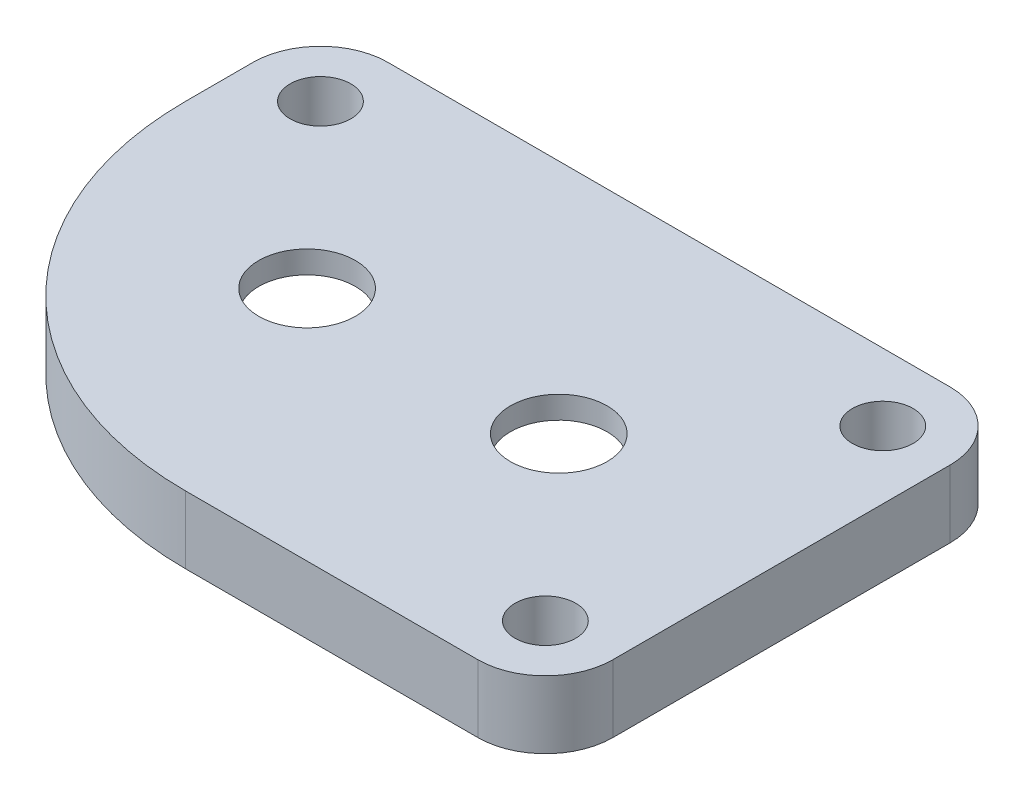
ISO-10303-21;
HEADER;
FILE_DESCRIPTION(('STEP AP214'),'2;1');
FILE_NAME('part.step','',(''),(''),'','','');
FILE_SCHEMA(('AUTOMOTIVE_DESIGN { 1 0 10303 214 1 1 1 1 }'));
ENDSEC;
DATA;
#1=APPLICATION_CONTEXT('core data for automotive mechanical design processes');
#2=APPLICATION_PROTOCOL_DEFINITION('international standard','automotive_design',2000,#1);
#3=PRODUCT_CONTEXT('',#1,'mechanical');
#4=PRODUCT('Part','Part','',(#3));
#5=PRODUCT_RELATED_PRODUCT_CATEGORY('part','',(#4));
#6=PRODUCT_DEFINITION_FORMATION('','',#4);
#7=PRODUCT_DEFINITION_CONTEXT('part definition',#1,'design');
#8=PRODUCT_DEFINITION('design','',#6,#7);
#9=PRODUCT_DEFINITION_SHAPE('','',#8);
#10=(LENGTH_UNIT() NAMED_UNIT(*) SI_UNIT(.MILLI.,.METRE.));
#11=(NAMED_UNIT(*) PLANE_ANGLE_UNIT() SI_UNIT($,.RADIAN.));
#12=(NAMED_UNIT(*) SI_UNIT($,.STERADIAN.) SOLID_ANGLE_UNIT());
#13=UNCERTAINTY_MEASURE_WITH_UNIT(LENGTH_MEASURE(1.E-05),#10,'distance_accuracy_value','');
#14=(GEOMETRIC_REPRESENTATION_CONTEXT(3) GLOBAL_UNCERTAINTY_ASSIGNED_CONTEXT((#13)) GLOBAL_UNIT_ASSIGNED_CONTEXT((#10,
#11,#12)) REPRESENTATION_CONTEXT('',''));
#15=CARTESIAN_POINT('',(0.,0.,0.));
#16=DIRECTION('',(0.,0.,1.));
#17=DIRECTION('',(1.,0.,0.));
#18=AXIS2_PLACEMENT_3D('',#15,#16,#17);
#19=CARTESIAN_POINT('',(0.,3.,0.));
#20=DIRECTION('',(0.,-1.,0.));
#21=DIRECTION('',(0.,0.,-1.));
#22=AXIS2_PLACEMENT_3D('',#19,#20,#21);
#23=CYLINDRICAL_SURFACE('',#22,2.15);
#24=CARTESIAN_POINT('',(0.,3.,0.));
#25=DIRECTION('',(0.,1.,0.));
#26=DIRECTION('',(0.,0.,1.));
#27=AXIS2_PLACEMENT_3D('',#24,#25,#26);
#28=CIRCLE('',#27,2.15);
#29=CARTESIAN_POINT('',(0.,3.,2.15));
#30=VERTEX_POINT('',#29);
#31=EDGE_CURVE('E166',#30,#30,#28,.T.);
#32=ORIENTED_EDGE('',*,*,#31,.T.);
#33=EDGE_LOOP('',(#32));
#34=FACE_BOUND('',#33,.T.);
#35=CARTESIAN_POINT('',(0.,2.,0.));
#36=DIRECTION('',(0.,-1.,0.));
#37=DIRECTION('',(0.,0.,-1.));
#38=AXIS2_PLACEMENT_3D('',#35,#36,#37);
#39=CIRCLE('',#38,2.15);
#40=CARTESIAN_POINT('',(0.,2.,-2.15));
#41=VERTEX_POINT('',#40);
#42=EDGE_CURVE('E259',#41,#41,#39,.T.);
#43=ORIENTED_EDGE('',*,*,#42,.T.);
#44=EDGE_LOOP('',(#43));
#45=FACE_BOUND('',#44,.T.);
#46=ADVANCED_FACE('F45',(#34,#45),#23,.F.);
#47=CARTESIAN_POINT('',(11.19,3.,0.));
#48=DIRECTION('',(0.,-1.,0.));
#49=DIRECTION('',(0.,0.,-1.));
#50=AXIS2_PLACEMENT_3D('',#47,#48,#49);
#51=CYLINDRICAL_SURFACE('',#50,2.15);
#52=CARTESIAN_POINT('',(11.19,3.,0.));
#53=DIRECTION('',(0.,1.,0.));
#54=DIRECTION('',(0.,0.,1.));
#55=AXIS2_PLACEMENT_3D('',#52,#53,#54);
#56=CIRCLE('',#55,2.15);
#57=CARTESIAN_POINT('',(11.19,3.,2.15));
#58=VERTEX_POINT('',#57);
#59=EDGE_CURVE('E234',#58,#58,#56,.T.);
#60=ORIENTED_EDGE('',*,*,#59,.T.);
#61=EDGE_LOOP('',(#60));
#62=FACE_BOUND('',#61,.T.);
#63=CARTESIAN_POINT('',(11.19,2.,0.));
#64=DIRECTION('',(0.,-1.,0.));
#65=DIRECTION('',(0.,0.,-1.));
#66=AXIS2_PLACEMENT_3D('',#63,#64,#65);
#67=CIRCLE('',#66,2.15);
#68=CARTESIAN_POINT('',(11.19,2.,-2.15));
#69=VERTEX_POINT('',#68);
#70=EDGE_CURVE('E49',#69,#69,#67,.T.);
#71=ORIENTED_EDGE('',*,*,#70,.T.);
#72=EDGE_LOOP('',(#71));
#73=FACE_BOUND('',#72,.T.);
#74=ADVANCED_FACE('F351',(#62,#73),#51,.F.);
#75=CARTESIAN_POINT('',(-6.905,3.,-7.5));
#76=DIRECTION('',(0.,-1.,0.));
#77=DIRECTION('',(0.,0.,-1.));
#78=AXIS2_PLACEMENT_3D('',#75,#76,#77);
#79=PLANE('',#78);
#80=CARTESIAN_POINT('',(-6.905,3.,-7.5));
#81=DIRECTION('',(0.,1.,0.));
#82=DIRECTION('',(0.,0.,-1.));
#83=AXIS2_PLACEMENT_3D('',#80,#81,#82);
#84=CIRCLE('',#83,3.);
#85=CARTESIAN_POINT('',(-6.905,3.,-10.5));
#86=VERTEX_POINT('',#85);
#87=CARTESIAN_POINT('',(-9.905,3.,-7.5));
#88=VERTEX_POINT('',#87);
#89=EDGE_CURVE('E185',#86,#88,#84,.T.);
#90=ORIENTED_EDGE('',*,*,#89,.T.);
#91=DIRECTION('',(0.,0.,1.));
#92=VECTOR('',#91,1.);
#93=CARTESIAN_POINT('',(-9.905,3.,-4.5));
#94=LINE('',#93,#92);
#95=CARTESIAN_POINT('',(-9.905,3.,-4.5));
#96=VERTEX_POINT('',#95);
#97=EDGE_CURVE('E112',#88,#96,#94,.T.);
#98=ORIENTED_EDGE('',*,*,#97,.T.);
#99=CARTESIAN_POINT('',(5.095,3.,-4.5));
#100=DIRECTION('',(0.,1.,0.));
#101=DIRECTION('',(0.,0.,-1.));
#102=AXIS2_PLACEMENT_3D('',#99,#100,#101);
#103=CIRCLE('',#102,15.);
#104=CARTESIAN_POINT('',(5.095,3.,10.5));
#105=VERTEX_POINT('',#104);
#106=EDGE_CURVE('E207',#96,#105,#103,.T.);
#107=ORIENTED_EDGE('',*,*,#106,.T.);
#108=DIRECTION('',(1.,0.,0.));
#109=VECTOR('',#108,1.);
#110=CARTESIAN_POINT('',(5.095,3.,10.5));
#111=LINE('',#110,#109);
#112=CARTESIAN_POINT('',(18.095,3.,10.5));
#113=VERTEX_POINT('',#112);
#114=EDGE_CURVE('E221',#105,#113,#111,.T.);
#115=ORIENTED_EDGE('',*,*,#114,.T.);
#116=CARTESIAN_POINT('',(18.095,3.,7.5));
#117=DIRECTION('',(0.,1.,0.));
#118=DIRECTION('',(0.,0.,1.));
#119=AXIS2_PLACEMENT_3D('',#116,#117,#118);
#120=CIRCLE('',#119,3.);
#121=CARTESIAN_POINT('',(21.095,3.,7.5));
#122=VERTEX_POINT('',#121);
#123=EDGE_CURVE('E136',#113,#122,#120,.T.);
#124=ORIENTED_EDGE('',*,*,#123,.T.);
#125=DIRECTION('',(0.,0.,-1.));
#126=VECTOR('',#125,1.);
#127=CARTESIAN_POINT('',(21.095,3.,7.5));
#128=LINE('',#127,#126);
#129=CARTESIAN_POINT('',(21.095,3.,-7.5));
#130=VERTEX_POINT('',#129);
#131=EDGE_CURVE('E128',#122,#130,#128,.T.);
#132=ORIENTED_EDGE('',*,*,#131,.T.);
#133=CARTESIAN_POINT('',(18.095,3.,-7.5));
#134=DIRECTION('',(0.,1.,0.));
#135=DIRECTION('',(0.,0.,-1.));
#136=AXIS2_PLACEMENT_3D('',#133,#134,#135);
#137=CIRCLE('',#136,3.);
#138=CARTESIAN_POINT('',(18.095,3.,-10.5));
#139=VERTEX_POINT('',#138);
#140=EDGE_CURVE('E133',#130,#139,#137,.T.);
#141=ORIENTED_EDGE('',*,*,#140,.T.);
#142=DIRECTION('',(-1.,0.,0.));
#143=VECTOR('',#142,1.);
#144=CARTESIAN_POINT('',(-6.905,3.,-10.5));
#145=LINE('',#144,#143);
#146=EDGE_CURVE('E71',#139,#86,#145,.T.);
#147=ORIENTED_EDGE('',*,*,#146,.T.);
#148=EDGE_LOOP('',(#90,#98,#107,#115,#124,#132,#141,#147));
#149=FACE_BOUND('',#148,.T.);
#150=ORIENTED_EDGE('',*,*,#31,.F.);
#151=EDGE_LOOP('',(#150));
#152=FACE_BOUND('',#151,.T.);
#153=ORIENTED_EDGE('',*,*,#59,.F.);
#154=EDGE_LOOP('',(#153));
#155=FACE_BOUND('',#154,.T.);
#156=CARTESIAN_POINT('',(-6.905,3.,-7.5));
#157=DIRECTION('',(0.,1.,0.));
#158=DIRECTION('',(0.,0.,1.));
#159=AXIS2_PLACEMENT_3D('',#156,#157,#158);
#160=CIRCLE('',#159,1.35);
#161=CARTESIAN_POINT('',(-6.905,3.,-6.15000000000001));
#162=VERTEX_POINT('',#161);
#163=EDGE_CURVE('E238',#162,#162,#160,.T.);
#164=ORIENTED_EDGE('',*,*,#163,.F.);
#165=EDGE_LOOP('',(#164));
#166=FACE_BOUND('',#165,.T.);
#167=CARTESIAN_POINT('',(18.095,3.,-7.5));
#168=DIRECTION('',(0.,1.,0.));
#169=DIRECTION('',(0.,0.,1.));
#170=AXIS2_PLACEMENT_3D('',#167,#168,#169);
#171=CIRCLE('',#170,1.35);
#172=CARTESIAN_POINT('',(18.095,3.,-6.15));
#173=VERTEX_POINT('',#172);
#174=EDGE_CURVE('E243',#173,#173,#171,.T.);
#175=ORIENTED_EDGE('',*,*,#174,.F.);
#176=EDGE_LOOP('',(#175));
#177=FACE_BOUND('',#176,.T.);
#178=CARTESIAN_POINT('',(18.095,3.,7.5));
#179=DIRECTION('',(0.,1.,0.));
#180=DIRECTION('',(0.,0.,1.));
#181=AXIS2_PLACEMENT_3D('',#178,#179,#180);
#182=CIRCLE('',#181,1.35);
#183=CARTESIAN_POINT('',(18.095,3.,8.85));
#184=VERTEX_POINT('',#183);
#185=EDGE_CURVE('E251',#184,#184,#182,.T.);
#186=ORIENTED_EDGE('',*,*,#185,.F.);
#187=EDGE_LOOP('',(#186));
#188=FACE_BOUND('',#187,.T.);
#189=ADVANCED_FACE('F130',(#149,#152,#155,#166,#177,#188),#79,.F.);
#190=CARTESIAN_POINT('',(-6.905,0.,-7.5));
#191=DIRECTION('',(0.,-1.,0.));
#192=DIRECTION('',(0.,0.,-1.));
#193=AXIS2_PLACEMENT_3D('',#190,#191,#192);
#194=PLANE('',#193);
#195=CARTESIAN_POINT('',(0.,0.,0.));
#196=DIRECTION('',(0.,-1.,0.));
#197=DIRECTION('',(0.,0.,-1.));
#198=AXIS2_PLACEMENT_3D('',#195,#196,#197);
#199=CIRCLE('',#198,6.29609526986509);
#200=CARTESIAN_POINT('',(0.,0.,6.29609526986509));
#201=VERTEX_POINT('',#200);
#202=CARTESIAN_POINT('',(0.,0.,-6.29609526986509));
#203=VERTEX_POINT('',#202);
#204=EDGE_CURVE('E62',#201,#203,#199,.T.);
#205=ORIENTED_EDGE('',*,*,#204,.F.);
#206=DIRECTION('',(-1.,0.,0.));
#207=VECTOR('',#206,1.);
#208=CARTESIAN_POINT('',(0.,0.,6.29609526986509));
#209=LINE('',#208,#207);
#210=CARTESIAN_POINT('',(11.19,0.,6.29609526986509));
#211=VERTEX_POINT('',#210);
#212=EDGE_CURVE('E281',#211,#201,#209,.T.);
#213=ORIENTED_EDGE('',*,*,#212,.F.);
#214=CARTESIAN_POINT('',(11.19,0.,0.));
#215=DIRECTION('',(0.,-1.,0.));
#216=DIRECTION('',(0.,0.,-1.));
#217=AXIS2_PLACEMENT_3D('',#214,#215,#216);
#218=CIRCLE('',#217,6.29609526986509);
#219=CARTESIAN_POINT('',(11.19,0.,-6.29609526986509));
#220=VERTEX_POINT('',#219);
#221=EDGE_CURVE('E286',#220,#211,#218,.T.);
#222=ORIENTED_EDGE('',*,*,#221,.F.);
#223=DIRECTION('',(1.,0.,0.));
#224=VECTOR('',#223,1.);
#225=CARTESIAN_POINT('',(0.,0.,-6.29609526986509));
#226=LINE('',#225,#224);
#227=EDGE_CURVE('E290',#203,#220,#226,.T.);
#228=ORIENTED_EDGE('',*,*,#227,.F.);
#229=EDGE_LOOP('',(#205,#213,#222,#228));
#230=FACE_BOUND('',#229,.T.);
#231=CARTESIAN_POINT('',(18.095,0.,-7.5));
#232=DIRECTION('',(0.,1.,0.));
#233=DIRECTION('',(0.,0.,1.));
#234=AXIS2_PLACEMENT_3D('',#231,#232,#233);
#235=CIRCLE('',#234,1.35);
#236=CARTESIAN_POINT('',(18.095,0.,-6.15));
#237=VERTEX_POINT('',#236);
#238=EDGE_CURVE('E247',#237,#237,#235,.T.);
#239=ORIENTED_EDGE('',*,*,#238,.T.);
#240=EDGE_LOOP('',(#239));
#241=FACE_BOUND('',#240,.T.);
#242=CARTESIAN_POINT('',(-6.905,0.,-7.5));
#243=DIRECTION('',(0.,1.,0.));
#244=DIRECTION('',(0.,0.,-1.));
#245=AXIS2_PLACEMENT_3D('',#242,#243,#244);
#246=CIRCLE('',#245,3.);
#247=CARTESIAN_POINT('',(-6.905,0.,-10.5));
#248=VERTEX_POINT('',#247);
#249=CARTESIAN_POINT('',(-9.905,0.,-7.5));
#250=VERTEX_POINT('',#249);
#251=EDGE_CURVE('E161',#248,#250,#246,.T.);
#252=ORIENTED_EDGE('',*,*,#251,.F.);
#253=DIRECTION('',(-1.,0.,0.));
#254=VECTOR('',#253,1.);
#255=CARTESIAN_POINT('',(-6.905,0.,-10.5));
#256=LINE('',#255,#254);
#257=CARTESIAN_POINT('',(18.095,0.,-10.5));
#258=VERTEX_POINT('',#257);
#259=EDGE_CURVE('E104',#258,#248,#256,.T.);
#260=ORIENTED_EDGE('',*,*,#259,.F.);
#261=CARTESIAN_POINT('',(18.095,0.,-7.5));
#262=DIRECTION('',(0.,1.,0.));
#263=DIRECTION('',(0.,0.,-1.));
#264=AXIS2_PLACEMENT_3D('',#261,#262,#263);
#265=CIRCLE('',#264,3.);
#266=CARTESIAN_POINT('',(21.095,0.,-7.5));
#267=VERTEX_POINT('',#266);
#268=EDGE_CURVE('E180',#267,#258,#265,.T.);
#269=ORIENTED_EDGE('',*,*,#268,.F.);
#270=DIRECTION('',(0.,0.,-1.));
#271=VECTOR('',#270,1.);
#272=CARTESIAN_POINT('',(21.095,0.,7.5));
#273=LINE('',#272,#271);
#274=CARTESIAN_POINT('',(21.095,0.,7.5));
#275=VERTEX_POINT('',#274);
#276=EDGE_CURVE('E146',#275,#267,#273,.T.);
#277=ORIENTED_EDGE('',*,*,#276,.F.);
#278=CARTESIAN_POINT('',(18.095,0.,7.5));
#279=DIRECTION('',(0.,1.,0.));
#280=DIRECTION('',(0.,0.,1.));
#281=AXIS2_PLACEMENT_3D('',#278,#279,#280);
#282=CIRCLE('',#281,3.);
#283=CARTESIAN_POINT('',(18.095,0.,10.5));
#284=VERTEX_POINT('',#283);
#285=EDGE_CURVE('E175',#284,#275,#282,.T.);
#286=ORIENTED_EDGE('',*,*,#285,.F.);
#287=DIRECTION('',(1.,0.,0.));
#288=VECTOR('',#287,1.);
#289=CARTESIAN_POINT('',(5.095,0.,10.5));
#290=LINE('',#289,#288);
#291=CARTESIAN_POINT('',(5.095,0.,10.5));
#292=VERTEX_POINT('',#291);
#293=EDGE_CURVE('E172',#292,#284,#290,.T.);
#294=ORIENTED_EDGE('',*,*,#293,.F.);
#295=CARTESIAN_POINT('',(5.095,0.,-4.5));
#296=DIRECTION('',(0.,1.,0.));
#297=DIRECTION('',(0.,0.,-1.));
#298=AXIS2_PLACEMENT_3D('',#295,#296,#297);
#299=CIRCLE('',#298,15.);
#300=CARTESIAN_POINT('',(-9.905,0.,-4.5));
#301=VERTEX_POINT('',#300);
#302=EDGE_CURVE('E169',#301,#292,#299,.T.);
#303=ORIENTED_EDGE('',*,*,#302,.F.);
#304=DIRECTION('',(0.,0.,1.));
#305=VECTOR('',#304,1.);
#306=CARTESIAN_POINT('',(-9.905,0.,-4.5));
#307=LINE('',#306,#305);
#308=EDGE_CURVE('E165',#250,#301,#307,.T.);
#309=ORIENTED_EDGE('',*,*,#308,.F.);
#310=EDGE_LOOP('',(#252,#260,#269,#277,#286,#294,#303,#309));
#311=FACE_BOUND('',#310,.T.);
#312=CARTESIAN_POINT('',(-6.905,0.,-7.5));
#313=DIRECTION('',(0.,1.,0.));
#314=DIRECTION('',(0.,0.,1.));
#315=AXIS2_PLACEMENT_3D('',#312,#313,#314);
#316=CIRCLE('',#315,1.35);
#317=CARTESIAN_POINT('',(-6.905,0.,-6.15000000000001));
#318=VERTEX_POINT('',#317);
#319=EDGE_CURVE('E239',#318,#318,#316,.T.);
#320=ORIENTED_EDGE('',*,*,#319,.T.);
#321=EDGE_LOOP('',(#320));
#322=FACE_BOUND('',#321,.T.);
#323=CARTESIAN_POINT('',(18.095,0.,7.5));
#324=DIRECTION('',(0.,1.,0.));
#325=DIRECTION('',(0.,0.,1.));
#326=AXIS2_PLACEMENT_3D('',#323,#324,#325);
#327=CIRCLE('',#326,1.35);
#328=CARTESIAN_POINT('',(18.095,0.,8.85));
#329=VERTEX_POINT('',#328);
#330=EDGE_CURVE('E255',#329,#329,#327,.T.);
#331=ORIENTED_EDGE('',*,*,#330,.T.);
#332=EDGE_LOOP('',(#331));
#333=FACE_BOUND('',#332,.T.);
#334=ADVANCED_FACE('F211',(#230,#241,#311,#322,#333),#194,.T.);
#335=CARTESIAN_POINT('',(-6.905,3.,-7.5));
#336=DIRECTION('',(0.,-1.,0.));
#337=DIRECTION('',(0.,0.,-1.));
#338=AXIS2_PLACEMENT_3D('',#335,#336,#337);
#339=CYLINDRICAL_SURFACE('',#338,3.);
#340=ORIENTED_EDGE('',*,*,#251,.T.);
#341=DIRECTION('',(0.,-1.,0.));
#342=VECTOR('',#341,1.);
#343=CARTESIAN_POINT('',(-9.905,3.,-7.5));
#344=LINE('',#343,#342);
#345=EDGE_CURVE('E11',#88,#250,#344,.T.);
#346=ORIENTED_EDGE('',*,*,#345,.F.);
#347=ORIENTED_EDGE('',*,*,#89,.F.);
#348=DIRECTION('',(0.,-1.,0.));
#349=VECTOR('',#348,1.);
#350=CARTESIAN_POINT('',(-6.905,3.,-10.5));
#351=LINE('',#350,#349);
#352=EDGE_CURVE('E157',#86,#248,#351,.T.);
#353=ORIENTED_EDGE('',*,*,#352,.T.);
#354=EDGE_LOOP('',(#340,#346,#347,#353));
#355=FACE_BOUND('',#354,.T.);
#356=ADVANCED_FACE('F47',(#355),#339,.T.);
#357=CARTESIAN_POINT('',(-9.905,3.,-4.5));
#358=DIRECTION('',(1.,0.,0.));
#359=DIRECTION('',(0.,0.,-1.));
#360=AXIS2_PLACEMENT_3D('',#357,#358,#359);
#361=PLANE('',#360);
#362=ORIENTED_EDGE('',*,*,#308,.T.);
#363=DIRECTION('',(0.,-1.,0.));
#364=VECTOR('',#363,1.);
#365=CARTESIAN_POINT('',(-9.905,3.,-4.5));
#366=LINE('',#365,#364);
#367=EDGE_CURVE('E55',#96,#301,#366,.T.);
#368=ORIENTED_EDGE('',*,*,#367,.F.);
#369=ORIENTED_EDGE('',*,*,#97,.F.);
#370=ORIENTED_EDGE('',*,*,#345,.T.);
#371=EDGE_LOOP('',(#362,#368,#369,#370));
#372=FACE_BOUND('',#371,.T.);
#373=ADVANCED_FACE('F380',(#372),#361,.F.);
#374=CARTESIAN_POINT('',(5.095,3.,-4.5));
#375=DIRECTION('',(0.,-1.,0.));
#376=DIRECTION('',(0.,0.,-1.));
#377=AXIS2_PLACEMENT_3D('',#374,#375,#376);
#378=CYLINDRICAL_SURFACE('',#377,15.);
#379=ORIENTED_EDGE('',*,*,#302,.T.);
#380=DIRECTION('',(0.,-1.,0.));
#381=VECTOR('',#380,1.);
#382=CARTESIAN_POINT('',(5.095,3.,10.5));
#383=LINE('',#382,#381);
#384=EDGE_CURVE('E196',#105,#292,#383,.T.);
#385=ORIENTED_EDGE('',*,*,#384,.F.);
#386=ORIENTED_EDGE('',*,*,#106,.F.);
#387=ORIENTED_EDGE('',*,*,#367,.T.);
#388=EDGE_LOOP('',(#379,#385,#386,#387));
#389=FACE_BOUND('',#388,.T.);
#390=ADVANCED_FACE('F205',(#389),#378,.T.);
#391=CARTESIAN_POINT('',(5.095,3.,10.5));
#392=DIRECTION('',(0.,0.,-1.));
#393=DIRECTION('',(-1.,0.,0.));
#394=AXIS2_PLACEMENT_3D('',#391,#392,#393);
#395=PLANE('',#394);
#396=ORIENTED_EDGE('',*,*,#293,.T.);
#397=DIRECTION('',(0.,-1.,0.));
#398=VECTOR('',#397,1.);
#399=CARTESIAN_POINT('',(18.095,3.,10.5));
#400=LINE('',#399,#398);
#401=EDGE_CURVE('E192',#113,#284,#400,.T.);
#402=ORIENTED_EDGE('',*,*,#401,.F.);
#403=ORIENTED_EDGE('',*,*,#114,.F.);
#404=ORIENTED_EDGE('',*,*,#384,.T.);
#405=EDGE_LOOP('',(#396,#402,#403,#404));
#406=FACE_BOUND('',#405,.T.);
#407=ADVANCED_FACE('F216',(#406),#395,.F.);
#408=CARTESIAN_POINT('',(18.095,3.,7.5));
#409=DIRECTION('',(0.,-1.,0.));
#410=DIRECTION('',(0.,0.,-1.));
#411=AXIS2_PLACEMENT_3D('',#408,#409,#410);
#412=CYLINDRICAL_SURFACE('',#411,3.);
#413=ORIENTED_EDGE('',*,*,#285,.T.);
#414=DIRECTION('',(0.,-1.,0.));
#415=VECTOR('',#414,1.);
#416=CARTESIAN_POINT('',(21.095,3.,7.5));
#417=LINE('',#416,#415);
#418=EDGE_CURVE('E150',#122,#275,#417,.T.);
#419=ORIENTED_EDGE('',*,*,#418,.F.);
#420=ORIENTED_EDGE('',*,*,#123,.F.);
#421=ORIENTED_EDGE('',*,*,#401,.T.);
#422=EDGE_LOOP('',(#413,#419,#420,#421));
#423=FACE_BOUND('',#422,.T.);
#424=ADVANCED_FACE('F219',(#423),#412,.T.);
#425=CARTESIAN_POINT('',(21.095,3.,7.5));
#426=DIRECTION('',(-1.,0.,0.));
#427=DIRECTION('',(0.,0.,1.));
#428=AXIS2_PLACEMENT_3D('',#425,#426,#427);
#429=PLANE('',#428);
#430=ORIENTED_EDGE('',*,*,#276,.T.);
#431=DIRECTION('',(0.,-1.,0.));
#432=VECTOR('',#431,1.);
#433=CARTESIAN_POINT('',(21.095,3.,-7.5));
#434=LINE('',#433,#432);
#435=EDGE_CURVE('E143',#130,#267,#434,.T.);
#436=ORIENTED_EDGE('',*,*,#435,.F.);
#437=ORIENTED_EDGE('',*,*,#131,.F.);
#438=ORIENTED_EDGE('',*,*,#418,.T.);
#439=EDGE_LOOP('',(#430,#436,#437,#438));
#440=FACE_BOUND('',#439,.T.);
#441=ADVANCED_FACE('F144',(#440),#429,.F.);
#442=CARTESIAN_POINT('',(18.095,3.,-7.5));
#443=DIRECTION('',(0.,-1.,0.));
#444=DIRECTION('',(0.,0.,-1.));
#445=AXIS2_PLACEMENT_3D('',#442,#443,#444);
#446=CYLINDRICAL_SURFACE('',#445,3.);
#447=ORIENTED_EDGE('',*,*,#268,.T.);
#448=DIRECTION('',(0.,-1.,0.));
#449=VECTOR('',#448,1.);
#450=CARTESIAN_POINT('',(18.095,3.,-10.5));
#451=LINE('',#450,#449);
#452=EDGE_CURVE('E151',#139,#258,#451,.T.);
#453=ORIENTED_EDGE('',*,*,#452,.F.);
#454=ORIENTED_EDGE('',*,*,#140,.F.);
#455=ORIENTED_EDGE('',*,*,#435,.T.);
#456=EDGE_LOOP('',(#447,#453,#454,#455));
#457=FACE_BOUND('',#456,.T.);
#458=ADVANCED_FACE('F153',(#457),#446,.T.);
#459=CARTESIAN_POINT('',(-6.905,3.,-10.5));
#460=DIRECTION('',(0.,0.,1.));
#461=DIRECTION('',(1.,0.,0.));
#462=AXIS2_PLACEMENT_3D('',#459,#460,#461);
#463=PLANE('',#462);
#464=ORIENTED_EDGE('',*,*,#259,.T.);
#465=ORIENTED_EDGE('',*,*,#352,.F.);
#466=ORIENTED_EDGE('',*,*,#146,.F.);
#467=ORIENTED_EDGE('',*,*,#452,.T.);
#468=EDGE_LOOP('',(#464,#465,#466,#467));
#469=FACE_BOUND('',#468,.T.);
#470=ADVANCED_FACE('F367',(#469),#463,.F.);
#471=CARTESIAN_POINT('',(-6.905,3.,-7.5));
#472=DIRECTION('',(0.,-1.,0.));
#473=DIRECTION('',(0.,0.,-1.));
#474=AXIS2_PLACEMENT_3D('',#471,#472,#473);
#475=CYLINDRICAL_SURFACE('',#474,1.35);
#476=ORIENTED_EDGE('',*,*,#163,.T.);
#477=EDGE_LOOP('',(#476));
#478=FACE_BOUND('',#477,.T.);
#479=ORIENTED_EDGE('',*,*,#319,.F.);
#480=EDGE_LOOP('',(#479));
#481=FACE_BOUND('',#480,.T.);
#482=ADVANCED_FACE('F370',(#478,#481),#475,.F.);
#483=CARTESIAN_POINT('',(18.095,3.,-7.5));
#484=DIRECTION('',(0.,-1.,0.));
#485=DIRECTION('',(0.,0.,-1.));
#486=AXIS2_PLACEMENT_3D('',#483,#484,#485);
#487=CYLINDRICAL_SURFACE('',#486,1.35);
#488=ORIENTED_EDGE('',*,*,#174,.T.);
#489=EDGE_LOOP('',(#488));
#490=FACE_BOUND('',#489,.T.);
#491=ORIENTED_EDGE('',*,*,#238,.F.);
#492=EDGE_LOOP('',(#491));
#493=FACE_BOUND('',#492,.T.);
#494=ADVANCED_FACE('F451',(#490,#493),#487,.F.);
#495=CARTESIAN_POINT('',(18.095,3.,7.5));
#496=DIRECTION('',(0.,-1.,0.));
#497=DIRECTION('',(0.,0.,-1.));
#498=AXIS2_PLACEMENT_3D('',#495,#496,#497);
#499=CYLINDRICAL_SURFACE('',#498,1.35);
#500=ORIENTED_EDGE('',*,*,#185,.T.);
#501=EDGE_LOOP('',(#500));
#502=FACE_BOUND('',#501,.T.);
#503=ORIENTED_EDGE('',*,*,#330,.F.);
#504=EDGE_LOOP('',(#503));
#505=FACE_BOUND('',#504,.T.);
#506=ADVANCED_FACE('F411',(#502,#505),#499,.F.);
#507=CARTESIAN_POINT('',(0.,2.,0.));
#508=DIRECTION('',(0.,-1.,0.));
#509=DIRECTION('',(0.,0.,-1.));
#510=AXIS2_PLACEMENT_3D('',#507,#508,#509);
#511=CYLINDRICAL_SURFACE('',#510,6.29609526986509);
#512=ORIENTED_EDGE('',*,*,#204,.T.);
#513=DIRECTION('',(0.,-1.,0.));
#514=VECTOR('',#513,1.);
#515=CARTESIAN_POINT('',(0.,2.,-6.29609526986509));
#516=LINE('',#515,#514);
#517=CARTESIAN_POINT('',(0.,2.,-6.29609526986509));
#518=VERTEX_POINT('',#517);
#519=EDGE_CURVE('E266',#518,#203,#516,.T.);
#520=ORIENTED_EDGE('',*,*,#519,.F.);
#521=CARTESIAN_POINT('',(0.,2.,0.));
#522=DIRECTION('',(0.,-1.,0.));
#523=DIRECTION('',(0.,0.,-1.));
#524=AXIS2_PLACEMENT_3D('',#521,#522,#523);
#525=CIRCLE('',#524,6.29609526986509);
#526=CARTESIAN_POINT('',(0.,2.,6.29609526986509));
#527=VERTEX_POINT('',#526);
#528=EDGE_CURVE('E285',#527,#518,#525,.T.);
#529=ORIENTED_EDGE('',*,*,#528,.F.);
#530=DIRECTION('',(0.,-1.,0.));
#531=VECTOR('',#530,1.);
#532=CARTESIAN_POINT('',(0.,2.,6.29609526986509));
#533=LINE('',#532,#531);
#534=EDGE_CURVE('E278',#527,#201,#533,.T.);
#535=ORIENTED_EDGE('',*,*,#534,.T.);
#536=EDGE_LOOP('',(#512,#520,#529,#535));
#537=FACE_BOUND('',#536,.T.);
#538=ADVANCED_FACE('F317',(#537),#511,.F.);
#539=CARTESIAN_POINT('',(0.,2.,6.29609526986509));
#540=DIRECTION('',(0.,0.,1.));
#541=DIRECTION('',(1.,0.,0.));
#542=AXIS2_PLACEMENT_3D('',#539,#540,#541);
#543=PLANE('',#542);
#544=ORIENTED_EDGE('',*,*,#212,.T.);
#545=ORIENTED_EDGE('',*,*,#534,.F.);
#546=DIRECTION('',(-1.,0.,0.));
#547=VECTOR('',#546,1.);
#548=CARTESIAN_POINT('',(0.,2.,6.29609526986509));
#549=LINE('',#548,#547);
#550=CARTESIAN_POINT('',(11.19,2.,6.29609526986509));
#551=VERTEX_POINT('',#550);
#552=EDGE_CURVE('E270',#551,#527,#549,.T.);
#553=ORIENTED_EDGE('',*,*,#552,.F.);
#554=DIRECTION('',(0.,-1.,0.));
#555=VECTOR('',#554,1.);
#556=CARTESIAN_POINT('',(11.19,2.,6.29609526986509));
#557=LINE('',#556,#555);
#558=EDGE_CURVE('E274',#551,#211,#557,.T.);
#559=ORIENTED_EDGE('',*,*,#558,.T.);
#560=EDGE_LOOP('',(#544,#545,#553,#559));
#561=FACE_BOUND('',#560,.T.);
#562=ADVANCED_FACE('F328',(#561),#543,.F.);
#563=CARTESIAN_POINT('',(11.19,2.,0.));
#564=DIRECTION('',(0.,-1.,0.));
#565=DIRECTION('',(0.,0.,-1.));
#566=AXIS2_PLACEMENT_3D('',#563,#564,#565);
#567=CYLINDRICAL_SURFACE('',#566,6.29609526986509);
#568=ORIENTED_EDGE('',*,*,#221,.T.);
#569=ORIENTED_EDGE('',*,*,#558,.F.);
#570=CARTESIAN_POINT('',(11.19,2.,0.));
#571=DIRECTION('',(0.,-1.,0.));
#572=DIRECTION('',(0.,0.,-1.));
#573=AXIS2_PLACEMENT_3D('',#570,#571,#572);
#574=CIRCLE('',#573,6.29609526986509);
#575=CARTESIAN_POINT('',(11.19,2.,-6.29609526986509));
#576=VERTEX_POINT('',#575);
#577=EDGE_CURVE('E299',#576,#551,#574,.T.);
#578=ORIENTED_EDGE('',*,*,#577,.F.);
#579=DIRECTION('',(0.,-1.,0.));
#580=VECTOR('',#579,1.);
#581=CARTESIAN_POINT('',(11.19,2.,-6.29609526986509));
#582=LINE('',#581,#580);
#583=EDGE_CURVE('E269',#576,#220,#582,.T.);
#584=ORIENTED_EDGE('',*,*,#583,.T.);
#585=EDGE_LOOP('',(#568,#569,#578,#584));
#586=FACE_BOUND('',#585,.T.);
#587=ADVANCED_FACE('F333',(#586),#567,.F.);
#588=CARTESIAN_POINT('',(0.,2.,-6.29609526986509));
#589=DIRECTION('',(0.,0.,-1.));
#590=DIRECTION('',(-1.,0.,0.));
#591=AXIS2_PLACEMENT_3D('',#588,#589,#590);
#592=PLANE('',#591);
#593=ORIENTED_EDGE('',*,*,#227,.T.);
#594=ORIENTED_EDGE('',*,*,#583,.F.);
#595=DIRECTION('',(1.,0.,0.));
#596=VECTOR('',#595,1.);
#597=CARTESIAN_POINT('',(0.,2.,-6.29609526986509));
#598=LINE('',#597,#596);
#599=EDGE_CURVE('E303',#518,#576,#598,.T.);
#600=ORIENTED_EDGE('',*,*,#599,.F.);
#601=ORIENTED_EDGE('',*,*,#519,.T.);
#602=EDGE_LOOP('',(#593,#594,#600,#601));
#603=FACE_BOUND('',#602,.T.);
#604=ADVANCED_FACE('F339',(#603),#592,.F.);
#605=CARTESIAN_POINT('',(0.,2.,0.));
#606=DIRECTION('',(0.,-1.,0.));
#607=DIRECTION('',(0.,0.,-1.));
#608=AXIS2_PLACEMENT_3D('',#605,#606,#607);
#609=PLANE('',#608);
#610=ORIENTED_EDGE('',*,*,#42,.F.);
#611=EDGE_LOOP('',(#610));
#612=FACE_BOUND('',#611,.T.);
#613=ORIENTED_EDGE('',*,*,#70,.F.);
#614=EDGE_LOOP('',(#613));
#615=FACE_BOUND('',#614,.T.);
#616=ORIENTED_EDGE('',*,*,#528,.T.);
#617=ORIENTED_EDGE('',*,*,#599,.T.);
#618=ORIENTED_EDGE('',*,*,#577,.T.);
#619=ORIENTED_EDGE('',*,*,#552,.T.);
#620=EDGE_LOOP('',(#616,#617,#618,#619));
#621=FACE_BOUND('',#620,.T.);
#622=ADVANCED_FACE('F312',(#612,#615,#621),#609,.T.);
#623=CLOSED_SHELL('',(#46,#74,#189,#334,#356,#373,#390,#407,#424,#441,#458,#470,#482,#494,#506,
#538,#562,#587,#604,#622));
#624=MANIFOLD_SOLID_BREP('B2',#623);
#625=ADVANCED_BREP_SHAPE_REPRESENTATION('',(#18,#624),#14);
#626=SHAPE_DEFINITION_REPRESENTATION(#9,#625);
ENDSEC;
END-ISO-10303-21;
